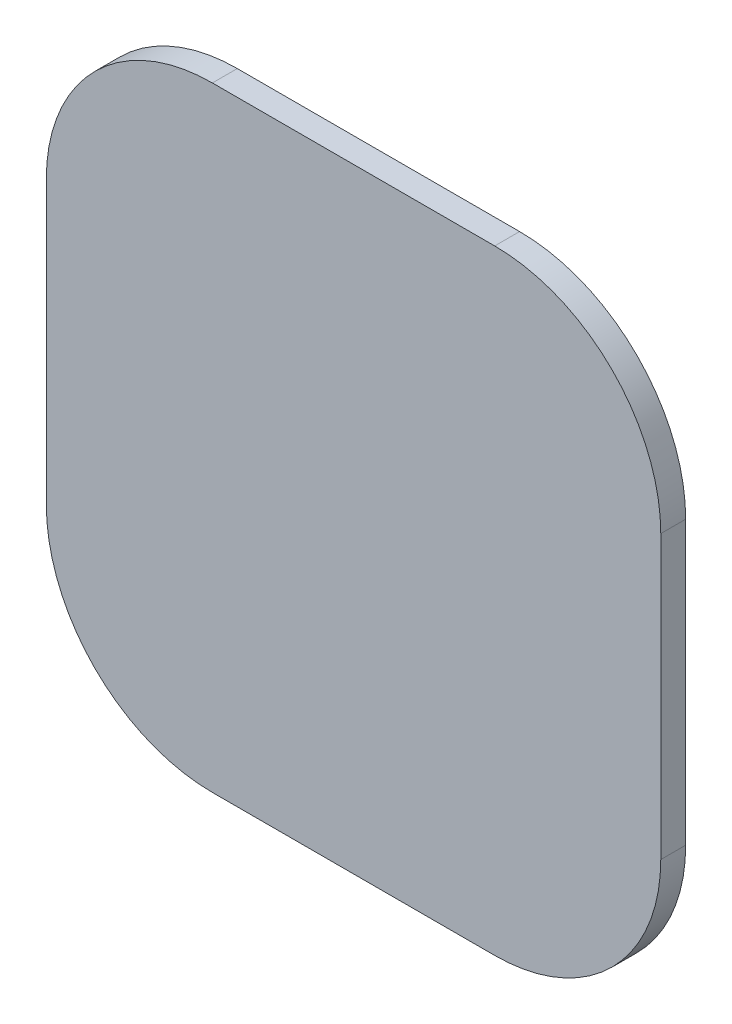
ISO-10303-21;
HEADER;
FILE_DESCRIPTION(('STEP AP214'),'2;1');
FILE_NAME('part.step','',(''),(''),'','','');
FILE_SCHEMA(('AUTOMOTIVE_DESIGN { 1 0 10303 214 1 1 1 1 }'));
ENDSEC;
DATA;
#1=APPLICATION_CONTEXT('core data for automotive mechanical design processes');
#2=APPLICATION_PROTOCOL_DEFINITION('international standard','automotive_design',2000,#1);
#3=PRODUCT_CONTEXT('',#1,'mechanical');
#4=PRODUCT('Part','Part','',(#3));
#5=PRODUCT_RELATED_PRODUCT_CATEGORY('part','',(#4));
#6=PRODUCT_DEFINITION_FORMATION('','',#4);
#7=PRODUCT_DEFINITION_CONTEXT('part definition',#1,'design');
#8=PRODUCT_DEFINITION('design','',#6,#7);
#9=PRODUCT_DEFINITION_SHAPE('','',#8);
#10=(LENGTH_UNIT() NAMED_UNIT(*) SI_UNIT(.MILLI.,.METRE.));
#11=(NAMED_UNIT(*) PLANE_ANGLE_UNIT() SI_UNIT($,.RADIAN.));
#12=(NAMED_UNIT(*) SI_UNIT($,.STERADIAN.) SOLID_ANGLE_UNIT());
#13=UNCERTAINTY_MEASURE_WITH_UNIT(LENGTH_MEASURE(1.E-05),#10,'distance_accuracy_value','');
#14=(GEOMETRIC_REPRESENTATION_CONTEXT(3) GLOBAL_UNCERTAINTY_ASSIGNED_CONTEXT((#13)) GLOBAL_UNIT_ASSIGNED_CONTEXT((#10,
#11,#12)) REPRESENTATION_CONTEXT('',''));
#15=CARTESIAN_POINT('',(0.,0.,0.));
#16=DIRECTION('',(0.,0.,1.));
#17=DIRECTION('',(1.,0.,0.));
#18=AXIS2_PLACEMENT_3D('',#15,#16,#17);
#19=CARTESIAN_POINT('',(27.55,0.,1.));
#20=DIRECTION('',(-1.,0.,0.));
#21=DIRECTION('',(0.,0.,1.));
#22=AXIS2_PLACEMENT_3D('',#19,#20,#21);
#23=PLANE('',#22);
#24=DIRECTION('',(0.,1.,0.));
#25=VECTOR('',#24,1.);
#26=CARTESIAN_POINT('',(27.55,0.,1.));
#27=LINE('',#26,#25);
#28=CARTESIAN_POINT('',(27.55,-17.55,1.));
#29=VERTEX_POINT('',#28);
#30=CARTESIAN_POINT('',(27.55,-0.55,1.));
#31=VERTEX_POINT('',#30);
#32=EDGE_CURVE('E188',#29,#31,#27,.T.);
#33=ORIENTED_EDGE('',*,*,#32,.F.);
#34=DIRECTION('',(0.,0.,-1.));
#35=VECTOR('',#34,1.);
#36=CARTESIAN_POINT('',(27.55,-17.55,1.));
#37=LINE('',#36,#35);
#38=CARTESIAN_POINT('',(27.55,-17.55,-0.5));
#39=VERTEX_POINT('',#38);
#40=EDGE_CURVE('E172',#29,#39,#37,.T.);
#41=ORIENTED_EDGE('',*,*,#40,.T.);
#42=DIRECTION('',(0.,1.,0.));
#43=VECTOR('',#42,1.);
#44=CARTESIAN_POINT('',(27.55,0.,-0.5));
#45=LINE('',#44,#43);
#46=CARTESIAN_POINT('',(27.55,-0.55,-0.5));
#47=VERTEX_POINT('',#46);
#48=EDGE_CURVE('E185',#39,#47,#45,.T.);
#49=ORIENTED_EDGE('',*,*,#48,.T.);
#50=DIRECTION('',(0.,0.,-1.));
#51=VECTOR('',#50,1.);
#52=CARTESIAN_POINT('',(27.55,-0.55,1.));
#53=LINE('',#52,#51);
#54=EDGE_CURVE('E191',#47,#31,#53,.F.);
#55=ORIENTED_EDGE('',*,*,#54,.T.);
#56=EDGE_LOOP('',(#33,#41,#49,#55));
#57=FACE_BOUND('',#56,.T.);
#58=ADVANCED_FACE('F101',(#57),#23,.F.);
#59=CARTESIAN_POINT('',(0.,9.45,1.));
#60=DIRECTION('',(0.,1.,0.));
#61=DIRECTION('',(0.,0.,1.));
#62=AXIS2_PLACEMENT_3D('',#59,#60,#61);
#63=PLANE('',#62);
#64=DIRECTION('',(1.,0.,0.));
#65=VECTOR('',#64,1.);
#66=CARTESIAN_POINT('',(0.,9.45,1.));
#67=LINE('',#66,#65);
#68=CARTESIAN_POINT('',(0.55,9.45,1.));
#69=VERTEX_POINT('',#68);
#70=CARTESIAN_POINT('',(17.55,9.45,1.));
#71=VERTEX_POINT('',#70);
#72=EDGE_CURVE('E229',#69,#71,#67,.T.);
#73=ORIENTED_EDGE('',*,*,#72,.T.);
#74=DIRECTION('',(0.,0.,-1.));
#75=VECTOR('',#74,1.);
#76=CARTESIAN_POINT('',(17.55,9.45,-0.5));
#77=LINE('',#76,#75);
#78=CARTESIAN_POINT('',(17.55,9.45,-0.5));
#79=VERTEX_POINT('',#78);
#80=EDGE_CURVE('E280',#71,#79,#77,.T.);
#81=ORIENTED_EDGE('',*,*,#80,.T.);
#82=DIRECTION('',(1.,0.,0.));
#83=VECTOR('',#82,1.);
#84=CARTESIAN_POINT('',(0.,9.45,-0.5));
#85=LINE('',#84,#83);
#86=CARTESIAN_POINT('',(0.55,9.45,-0.5));
#87=VERTEX_POINT('',#86);
#88=EDGE_CURVE('E197',#87,#79,#85,.T.);
#89=ORIENTED_EDGE('',*,*,#88,.F.);
#90=DIRECTION('',(0.,0.,-1.));
#91=VECTOR('',#90,1.);
#92=CARTESIAN_POINT('',(0.55,9.45,1.));
#93=LINE('',#92,#91);
#94=EDGE_CURVE('E277',#87,#69,#93,.F.);
#95=ORIENTED_EDGE('',*,*,#94,.T.);
#96=EDGE_LOOP('',(#73,#81,#89,#95));
#97=FACE_BOUND('',#96,.T.);
#98=ADVANCED_FACE('F287',(#97),#63,.T.);
#99=CARTESIAN_POINT('',(-9.45,0.,1.));
#100=DIRECTION('',(-1.,0.,0.));
#101=DIRECTION('',(0.,0.,1.));
#102=AXIS2_PLACEMENT_3D('',#99,#100,#101);
#103=PLANE('',#102);
#104=DIRECTION('',(0.,1.,0.));
#105=VECTOR('',#104,1.);
#106=CARTESIAN_POINT('',(-9.45,0.,1.));
#107=LINE('',#106,#105);
#108=CARTESIAN_POINT('',(-9.45,-17.55,1.));
#109=VERTEX_POINT('',#108);
#110=CARTESIAN_POINT('',(-9.45,-0.55,1.));
#111=VERTEX_POINT('',#110);
#112=EDGE_CURVE('E233',#109,#111,#107,.T.);
#113=ORIENTED_EDGE('',*,*,#112,.T.);
#114=DIRECTION('',(0.,0.,-1.));
#115=VECTOR('',#114,1.);
#116=CARTESIAN_POINT('',(-9.45,-0.55,1.));
#117=LINE('',#116,#115);
#118=CARTESIAN_POINT('',(-9.45,-0.55,-0.5));
#119=VERTEX_POINT('',#118);
#120=EDGE_CURVE('E12',#111,#119,#117,.T.);
#121=ORIENTED_EDGE('',*,*,#120,.T.);
#122=DIRECTION('',(0.,1.,0.));
#123=VECTOR('',#122,1.);
#124=CARTESIAN_POINT('',(-9.45,0.,-0.5));
#125=LINE('',#124,#123);
#126=CARTESIAN_POINT('',(-9.45,-17.55,-0.5));
#127=VERTEX_POINT('',#126);
#128=EDGE_CURVE('E202',#127,#119,#125,.T.);
#129=ORIENTED_EDGE('',*,*,#128,.F.);
#130=DIRECTION('',(0.,0.,-1.));
#131=VECTOR('',#130,1.);
#132=CARTESIAN_POINT('',(-9.45,-17.55,1.));
#133=LINE('',#132,#131);
#134=EDGE_CURVE('E110',#127,#109,#133,.F.);
#135=ORIENTED_EDGE('',*,*,#134,.T.);
#136=EDGE_LOOP('',(#113,#121,#129,#135));
#137=FACE_BOUND('',#136,.T.);
#138=ADVANCED_FACE('F294',(#137),#103,.T.);
#139=CARTESIAN_POINT('',(0.,-27.55,1.));
#140=DIRECTION('',(0.,1.,0.));
#141=DIRECTION('',(0.,0.,1.));
#142=AXIS2_PLACEMENT_3D('',#139,#140,#141);
#143=PLANE('',#142);
#144=DIRECTION('',(1.,0.,0.));
#145=VECTOR('',#144,1.);
#146=CARTESIAN_POINT('',(0.,-27.55,-0.5));
#147=LINE('',#146,#145);
#148=CARTESIAN_POINT('',(0.55,-27.55,-0.5));
#149=VERTEX_POINT('',#148);
#150=CARTESIAN_POINT('',(17.55,-27.55,-0.5));
#151=VERTEX_POINT('',#150);
#152=EDGE_CURVE('E198',#149,#151,#147,.T.);
#153=ORIENTED_EDGE('',*,*,#152,.T.);
#154=DIRECTION('',(0.,0.,-1.));
#155=VECTOR('',#154,1.);
#156=CARTESIAN_POINT('',(17.55,-27.55,1.));
#157=LINE('',#156,#155);
#158=CARTESIAN_POINT('',(17.55,-27.55,1.));
#159=VERTEX_POINT('',#158);
#160=EDGE_CURVE('E173',#151,#159,#157,.F.);
#161=ORIENTED_EDGE('',*,*,#160,.T.);
#162=DIRECTION('',(1.,0.,0.));
#163=VECTOR('',#162,1.);
#164=CARTESIAN_POINT('',(0.,-27.55,1.));
#165=LINE('',#164,#163);
#166=CARTESIAN_POINT('',(0.55,-27.55,1.));
#167=VERTEX_POINT('',#166);
#168=EDGE_CURVE('E223',#167,#159,#165,.T.);
#169=ORIENTED_EDGE('',*,*,#168,.F.);
#170=DIRECTION('',(0.,0.,-1.));
#171=VECTOR('',#170,1.);
#172=CARTESIAN_POINT('',(0.55,-27.55,-0.5));
#173=LINE('',#172,#171);
#174=EDGE_CURVE('E179',#167,#149,#173,.T.);
#175=ORIENTED_EDGE('',*,*,#174,.T.);
#176=EDGE_LOOP('',(#153,#161,#169,#175));
#177=FACE_BOUND('',#176,.T.);
#178=ADVANCED_FACE('F301',(#177),#143,.F.);
#179=CARTESIAN_POINT('',(0.,0.,1.));
#180=DIRECTION('',(0.,0.,1.));
#181=DIRECTION('',(1.,0.,0.));
#182=AXIS2_PLACEMENT_3D('',#179,#180,#181);
#183=PLANE('',#182);
#184=ORIENTED_EDGE('',*,*,#168,.T.);
#185=CARTESIAN_POINT('',(17.55,-17.55,1.));
#186=DIRECTION('',(0.,0.,1.));
#187=DIRECTION('',(1.,0.,0.));
#188=AXIS2_PLACEMENT_3D('',#185,#186,#187);
#189=CIRCLE('',#188,10.);
#190=EDGE_CURVE('E274',#159,#29,#189,.T.);
#191=ORIENTED_EDGE('',*,*,#190,.T.);
#192=ORIENTED_EDGE('',*,*,#32,.T.);
#193=CARTESIAN_POINT('',(17.55,-0.55,1.));
#194=DIRECTION('',(0.,0.,1.));
#195=DIRECTION('',(1.,0.,0.));
#196=AXIS2_PLACEMENT_3D('',#193,#194,#195);
#197=CIRCLE('',#196,10.);
#198=EDGE_CURVE('E271',#31,#71,#197,.T.);
#199=ORIENTED_EDGE('',*,*,#198,.T.);
#200=ORIENTED_EDGE('',*,*,#72,.F.);
#201=CARTESIAN_POINT('',(0.55,-0.55,1.));
#202=DIRECTION('',(0.,0.,1.));
#203=DIRECTION('',(1.,0.,0.));
#204=AXIS2_PLACEMENT_3D('',#201,#202,#203);
#205=CIRCLE('',#204,10.);
#206=EDGE_CURVE('E117',#69,#111,#205,.T.);
#207=ORIENTED_EDGE('',*,*,#206,.T.);
#208=ORIENTED_EDGE('',*,*,#112,.F.);
#209=CARTESIAN_POINT('',(0.55,-17.55,1.));
#210=DIRECTION('',(0.,0.,1.));
#211=DIRECTION('',(1.,0.,0.));
#212=AXIS2_PLACEMENT_3D('',#209,#210,#211);
#213=CIRCLE('',#212,10.);
#214=EDGE_CURVE('E266',#109,#167,#213,.T.);
#215=ORIENTED_EDGE('',*,*,#214,.T.);
#216=EDGE_LOOP('',(#184,#191,#192,#199,#200,#207,#208,#215));
#217=FACE_BOUND('',#216,.T.);
#218=ADVANCED_FACE('F296',(#217),#183,.T.);
#219=CARTESIAN_POINT('',(0.,0.,-0.5));
#220=DIRECTION('',(0.,0.,1.));
#221=DIRECTION('',(1.,0.,0.));
#222=AXIS2_PLACEMENT_3D('',#219,#220,#221);
#223=CYLINDRICAL_SURFACE('',#222,9.);
#224=CARTESIAN_POINT('',(0.,0.,-0.5));
#225=DIRECTION('',(0.,0.,1.));
#226=DIRECTION('',(1.,0.,0.));
#227=AXIS2_PLACEMENT_3D('',#224,#225,#226);
#228=CIRCLE('',#227,9.);
#229=CARTESIAN_POINT('',(9.,0.,-0.5));
#230=VERTEX_POINT('',#229);
#231=EDGE_CURVE('E215',#230,#230,#228,.T.);
#232=ORIENTED_EDGE('',*,*,#231,.F.);
#233=EDGE_LOOP('',(#232));
#234=FACE_BOUND('',#233,.T.);
#235=CARTESIAN_POINT('',(0.,0.,0.));
#236=DIRECTION('',(0.,0.,1.));
#237=DIRECTION('',(1.,0.,0.));
#238=AXIS2_PLACEMENT_3D('',#235,#236,#237);
#239=CIRCLE('',#238,9.);
#240=CARTESIAN_POINT('',(9.,0.,0.));
#241=VERTEX_POINT('',#240);
#242=EDGE_CURVE('E248',#241,#241,#239,.T.);
#243=ORIENTED_EDGE('',*,*,#242,.T.);
#244=EDGE_LOOP('',(#243));
#245=FACE_BOUND('',#244,.T.);
#246=ADVANCED_FACE('F324',(#234,#245),#223,.F.);
#247=CARTESIAN_POINT('',(18.1,0.,-0.5));
#248=DIRECTION('',(0.,0.,1.));
#249=DIRECTION('',(1.,0.,0.));
#250=AXIS2_PLACEMENT_3D('',#247,#248,#249);
#251=CYLINDRICAL_SURFACE('',#250,9.);
#252=CARTESIAN_POINT('',(18.1,0.,-0.5));
#253=DIRECTION('',(0.,0.,1.));
#254=DIRECTION('',(1.,0.,0.));
#255=AXIS2_PLACEMENT_3D('',#252,#253,#254);
#256=CIRCLE('',#255,9.);
#257=CARTESIAN_POINT('',(27.1,0.,-0.5));
#258=VERTEX_POINT('',#257);
#259=EDGE_CURVE('E211',#258,#258,#256,.T.);
#260=ORIENTED_EDGE('',*,*,#259,.F.);
#261=EDGE_LOOP('',(#260));
#262=FACE_BOUND('',#261,.T.);
#263=CARTESIAN_POINT('',(18.1,0.,0.));
#264=DIRECTION('',(0.,0.,1.));
#265=DIRECTION('',(1.,0.,0.));
#266=AXIS2_PLACEMENT_3D('',#263,#264,#265);
#267=CIRCLE('',#266,9.);
#268=CARTESIAN_POINT('',(27.1,0.,0.));
#269=VERTEX_POINT('',#268);
#270=EDGE_CURVE('E244',#269,#269,#267,.T.);
#271=ORIENTED_EDGE('',*,*,#270,.T.);
#272=EDGE_LOOP('',(#271));
#273=FACE_BOUND('',#272,.T.);
#274=ADVANCED_FACE('F338',(#262,#273),#251,.F.);
#275=CARTESIAN_POINT('',(18.1,-18.1,-0.5));
#276=DIRECTION('',(0.,0.,1.));
#277=DIRECTION('',(1.,0.,0.));
#278=AXIS2_PLACEMENT_3D('',#275,#276,#277);
#279=CYLINDRICAL_SURFACE('',#278,9.05);
#280=CARTESIAN_POINT('',(18.1,-18.1,-0.5));
#281=DIRECTION('',(0.,0.,1.));
#282=DIRECTION('',(1.,0.,0.));
#283=AXIS2_PLACEMENT_3D('',#280,#281,#282);
#284=CIRCLE('',#283,9.05);
#285=CARTESIAN_POINT('',(27.15,-18.1,-0.5));
#286=VERTEX_POINT('',#285);
#287=EDGE_CURVE('E204',#286,#286,#284,.T.);
#288=ORIENTED_EDGE('',*,*,#287,.F.);
#289=EDGE_LOOP('',(#288));
#290=FACE_BOUND('',#289,.T.);
#291=CARTESIAN_POINT('',(18.1,-18.1,0.));
#292=DIRECTION('',(0.,0.,1.));
#293=DIRECTION('',(1.,0.,0.));
#294=AXIS2_PLACEMENT_3D('',#291,#292,#293);
#295=CIRCLE('',#294,9.05);
#296=CARTESIAN_POINT('',(27.15,-18.1,0.));
#297=VERTEX_POINT('',#296);
#298=EDGE_CURVE('E240',#297,#297,#295,.T.);
#299=ORIENTED_EDGE('',*,*,#298,.T.);
#300=EDGE_LOOP('',(#299));
#301=FACE_BOUND('',#300,.T.);
#302=ADVANCED_FACE('F334',(#290,#301),#279,.F.);
#303=CARTESIAN_POINT('',(0.,-18.1,-0.5));
#304=DIRECTION('',(0.,0.,1.));
#305=DIRECTION('',(1.,0.,0.));
#306=AXIS2_PLACEMENT_3D('',#303,#304,#305);
#307=CYLINDRICAL_SURFACE('',#306,9.);
#308=CARTESIAN_POINT('',(0.,-18.1,-0.5));
#309=DIRECTION('',(0.,0.,1.));
#310=DIRECTION('',(1.,0.,0.));
#311=AXIS2_PLACEMENT_3D('',#308,#309,#310);
#312=CIRCLE('',#311,9.);
#313=CARTESIAN_POINT('',(9.,-18.1,-0.5));
#314=VERTEX_POINT('',#313);
#315=EDGE_CURVE('E219',#314,#314,#312,.T.);
#316=ORIENTED_EDGE('',*,*,#315,.F.);
#317=EDGE_LOOP('',(#316));
#318=FACE_BOUND('',#317,.T.);
#319=CARTESIAN_POINT('',(0.,-18.1,0.));
#320=DIRECTION('',(0.,0.,1.));
#321=DIRECTION('',(1.,0.,0.));
#322=AXIS2_PLACEMENT_3D('',#319,#320,#321);
#323=CIRCLE('',#322,9.);
#324=CARTESIAN_POINT('',(9.,-18.1,0.));
#325=VERTEX_POINT('',#324);
#326=EDGE_CURVE('E236',#325,#325,#323,.T.);
#327=ORIENTED_EDGE('',*,*,#326,.T.);
#328=EDGE_LOOP('',(#327));
#329=FACE_BOUND('',#328,.T.);
#330=ADVANCED_FACE('F337',(#318,#329),#307,.F.);
#331=CARTESIAN_POINT('',(0.,0.,-0.5));
#332=DIRECTION('',(0.,0.,1.));
#333=DIRECTION('',(1.,0.,0.));
#334=AXIS2_PLACEMENT_3D('',#331,#332,#333);
#335=PLANE('',#334);
#336=ORIENTED_EDGE('',*,*,#287,.T.);
#337=EDGE_LOOP('',(#336));
#338=FACE_BOUND('',#337,.T.);
#339=ORIENTED_EDGE('',*,*,#48,.F.);
#340=CARTESIAN_POINT('',(17.55,-17.55,-0.5));
#341=DIRECTION('',(0.,0.,1.));
#342=DIRECTION('',(1.,0.,0.));
#343=AXIS2_PLACEMENT_3D('',#340,#341,#342);
#344=CIRCLE('',#343,10.);
#345=EDGE_CURVE('E168',#39,#151,#344,.F.);
#346=ORIENTED_EDGE('',*,*,#345,.T.);
#347=ORIENTED_EDGE('',*,*,#152,.F.);
#348=CARTESIAN_POINT('',(0.55,-17.55,-0.5));
#349=DIRECTION('',(0.,0.,1.));
#350=DIRECTION('',(1.,0.,0.));
#351=AXIS2_PLACEMENT_3D('',#348,#349,#350);
#352=CIRCLE('',#351,10.);
#353=EDGE_CURVE('E190',#149,#127,#352,.F.);
#354=ORIENTED_EDGE('',*,*,#353,.T.);
#355=ORIENTED_EDGE('',*,*,#128,.T.);
#356=CARTESIAN_POINT('',(0.55,-0.55,-0.5));
#357=DIRECTION('',(0.,0.,1.));
#358=DIRECTION('',(1.,0.,0.));
#359=AXIS2_PLACEMENT_3D('',#356,#357,#358);
#360=CIRCLE('',#359,10.);
#361=EDGE_CURVE('E256',#119,#87,#360,.F.);
#362=ORIENTED_EDGE('',*,*,#361,.T.);
#363=ORIENTED_EDGE('',*,*,#88,.T.);
#364=CARTESIAN_POINT('',(17.55,-0.55,-0.5));
#365=DIRECTION('',(0.,0.,1.));
#366=DIRECTION('',(1.,0.,0.));
#367=AXIS2_PLACEMENT_3D('',#364,#365,#366);
#368=CIRCLE('',#367,10.);
#369=EDGE_CURVE('E180',#79,#47,#368,.F.);
#370=ORIENTED_EDGE('',*,*,#369,.T.);
#371=EDGE_LOOP('',(#339,#346,#347,#354,#355,#362,#363,#370));
#372=FACE_BOUND('',#371,.T.);
#373=ORIENTED_EDGE('',*,*,#259,.T.);
#374=EDGE_LOOP('',(#373));
#375=FACE_BOUND('',#374,.T.);
#376=ORIENTED_EDGE('',*,*,#231,.T.);
#377=EDGE_LOOP('',(#376));
#378=FACE_BOUND('',#377,.T.);
#379=ORIENTED_EDGE('',*,*,#315,.T.);
#380=EDGE_LOOP('',(#379));
#381=FACE_BOUND('',#380,.T.);
#382=ADVANCED_FACE('F193',(#338,#372,#375,#378,#381),#335,.F.);
#383=CARTESIAN_POINT('',(0.,0.,0.));
#384=DIRECTION('',(0.,0.,1.));
#385=DIRECTION('',(1.,0.,0.));
#386=AXIS2_PLACEMENT_3D('',#383,#384,#385);
#387=PLANE('',#386);
#388=ORIENTED_EDGE('',*,*,#326,.F.);
#389=EDGE_LOOP('',(#388));
#390=FACE_BOUND('',#389,.T.);
#391=ADVANCED_FACE('F332',(#390),#387,.F.);
#392=ORIENTED_EDGE('',*,*,#298,.F.);
#393=EDGE_LOOP('',(#392));
#394=FACE_BOUND('',#393,.T.);
#395=ADVANCED_FACE('F354',(#394),#387,.F.);
#396=ORIENTED_EDGE('',*,*,#270,.F.);
#397=EDGE_LOOP('',(#396));
#398=FACE_BOUND('',#397,.T.);
#399=ADVANCED_FACE('F330',(#398),#387,.F.);
#400=ORIENTED_EDGE('',*,*,#242,.F.);
#401=EDGE_LOOP('',(#400));
#402=FACE_BOUND('',#401,.T.);
#403=ADVANCED_FACE('F309',(#402),#387,.F.);
#404=CARTESIAN_POINT('',(17.55,-17.55,1.));
#405=DIRECTION('',(0.,0.,-1.));
#406=DIRECTION('',(-1.,0.,0.));
#407=AXIS2_PLACEMENT_3D('',#404,#405,#406);
#408=CYLINDRICAL_SURFACE('',#407,10.);
#409=ORIENTED_EDGE('',*,*,#190,.F.);
#410=ORIENTED_EDGE('',*,*,#160,.F.);
#411=ORIENTED_EDGE('',*,*,#345,.F.);
#412=ORIENTED_EDGE('',*,*,#40,.F.);
#413=EDGE_LOOP('',(#409,#410,#411,#412));
#414=FACE_BOUND('',#413,.T.);
#415=ADVANCED_FACE('F171',(#414),#408,.T.);
#416=CARTESIAN_POINT('',(17.55,-0.55,1.));
#417=DIRECTION('',(0.,0.,1.));
#418=DIRECTION('',(1.,0.,0.));
#419=AXIS2_PLACEMENT_3D('',#416,#417,#418);
#420=CYLINDRICAL_SURFACE('',#419,10.);
#421=ORIENTED_EDGE('',*,*,#198,.F.);
#422=ORIENTED_EDGE('',*,*,#54,.F.);
#423=ORIENTED_EDGE('',*,*,#369,.F.);
#424=ORIENTED_EDGE('',*,*,#80,.F.);
#425=EDGE_LOOP('',(#421,#422,#423,#424));
#426=FACE_BOUND('',#425,.T.);
#427=ADVANCED_FACE('F302',(#426),#420,.T.);
#428=CARTESIAN_POINT('',(0.55,-0.55,1.));
#429=DIRECTION('',(0.,0.,-1.));
#430=DIRECTION('',(-1.,0.,0.));
#431=AXIS2_PLACEMENT_3D('',#428,#429,#430);
#432=CYLINDRICAL_SURFACE('',#431,10.);
#433=ORIENTED_EDGE('',*,*,#206,.F.);
#434=ORIENTED_EDGE('',*,*,#94,.F.);
#435=ORIENTED_EDGE('',*,*,#361,.F.);
#436=ORIENTED_EDGE('',*,*,#120,.F.);
#437=EDGE_LOOP('',(#433,#434,#435,#436));
#438=FACE_BOUND('',#437,.T.);
#439=ADVANCED_FACE('F293',(#438),#432,.T.);
#440=CARTESIAN_POINT('',(0.55,-17.55,1.));
#441=DIRECTION('',(0.,0.,1.));
#442=DIRECTION('',(1.,0.,0.));
#443=AXIS2_PLACEMENT_3D('',#440,#441,#442);
#444=CYLINDRICAL_SURFACE('',#443,10.);
#445=ORIENTED_EDGE('',*,*,#214,.F.);
#446=ORIENTED_EDGE('',*,*,#134,.F.);
#447=ORIENTED_EDGE('',*,*,#353,.F.);
#448=ORIENTED_EDGE('',*,*,#174,.F.);
#449=EDGE_LOOP('',(#445,#446,#447,#448));
#450=FACE_BOUND('',#449,.T.);
#451=ADVANCED_FACE('F103',(#450),#444,.T.);
#452=CLOSED_SHELL('',(#58,#98,#138,#178,#218,#246,#274,#302,#330,#382,#391,#395,#399,#403,#415,
#427,#439,#451));
#453=MANIFOLD_SOLID_BREP('B2',#452);
#454=ADVANCED_BREP_SHAPE_REPRESENTATION('',(#18,#453),#14);
#455=SHAPE_DEFINITION_REPRESENTATION(#9,#454);
ENDSEC;
END-ISO-10303-21;
